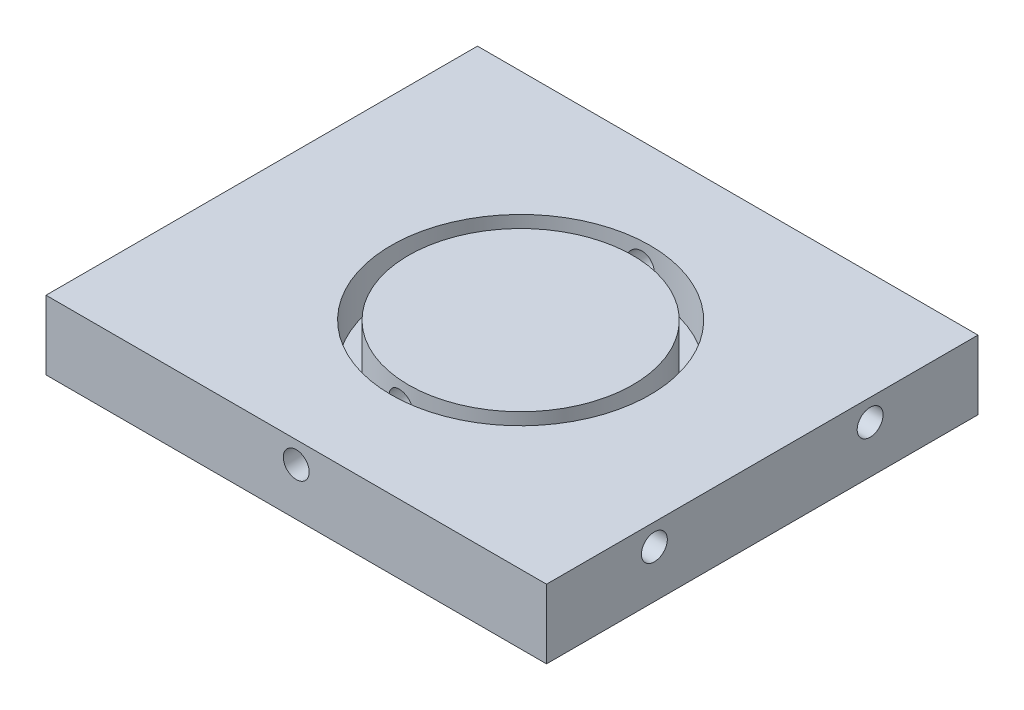
ISO-10303-21;
HEADER;
FILE_DESCRIPTION(('STEP AP214'),'2;1');
FILE_NAME('part.step','',(''),(''),'','','');
FILE_SCHEMA(('AUTOMOTIVE_DESIGN { 1 0 10303 214 1 1 1 1 }'));
ENDSEC;
DATA;
#1=APPLICATION_CONTEXT('core data for automotive mechanical design processes');
#2=APPLICATION_PROTOCOL_DEFINITION('international standard','automotive_design',2000,#1);
#3=PRODUCT_CONTEXT('',#1,'mechanical');
#4=PRODUCT('Part','Part','',(#3));
#5=PRODUCT_RELATED_PRODUCT_CATEGORY('part','',(#4));
#6=PRODUCT_DEFINITION_FORMATION('','',#4);
#7=PRODUCT_DEFINITION_CONTEXT('part definition',#1,'design');
#8=PRODUCT_DEFINITION('design','',#6,#7);
#9=PRODUCT_DEFINITION_SHAPE('','',#8);
#10=(LENGTH_UNIT() NAMED_UNIT(*) SI_UNIT(.MILLI.,.METRE.));
#11=(NAMED_UNIT(*) PLANE_ANGLE_UNIT() SI_UNIT($,.RADIAN.));
#12=(NAMED_UNIT(*) SI_UNIT($,.STERADIAN.) SOLID_ANGLE_UNIT());
#13=UNCERTAINTY_MEASURE_WITH_UNIT(LENGTH_MEASURE(1.E-05),#10,'distance_accuracy_value','');
#14=(GEOMETRIC_REPRESENTATION_CONTEXT(3) GLOBAL_UNCERTAINTY_ASSIGNED_CONTEXT((#13)) GLOBAL_UNIT_ASSIGNED_CONTEXT((#10,
#11,#12)) REPRESENTATION_CONTEXT('',''));
#15=CARTESIAN_POINT('',(0.,0.,0.));
#16=DIRECTION('',(0.,0.,1.));
#17=DIRECTION('',(1.,0.,0.));
#18=AXIS2_PLACEMENT_3D('',#15,#16,#17);
#19=CARTESIAN_POINT('',(-5.5,-45.,50.));
#20=DIRECTION('',(1.,0.,0.));
#21=DIRECTION('',(0.,1.,0.));
#22=AXIS2_PLACEMENT_3D('',#19,#20,#21);
#23=PLANE('',#22);
#24=CARTESIAN_POINT('',(-5.50000000000004,-47.5,12.5));
#25=DIRECTION('',(-1.,0.,0.));
#26=DIRECTION('',(0.,0.,1.));
#27=AXIS2_PLACEMENT_3D('',#24,#25,#26);
#28=CIRCLE('',#27,1.5);
#29=CARTESIAN_POINT('',(-5.50000000000004,-47.5,14.));
#30=VERTEX_POINT('',#29);
#31=EDGE_CURVE('E202',#30,#30,#28,.T.);
#32=ORIENTED_EDGE('',*,*,#31,.F.);
#33=EDGE_LOOP('',(#32));
#34=FACE_BOUND('',#33,.T.);
#35=CARTESIAN_POINT('',(-5.50000000000004,-47.5,37.5));
#36=DIRECTION('',(-1.,0.,0.));
#37=DIRECTION('',(0.,0.,1.));
#38=AXIS2_PLACEMENT_3D('',#35,#36,#37);
#39=CIRCLE('',#38,1.5);
#40=CARTESIAN_POINT('',(-5.50000000000004,-47.5,39.));
#41=VERTEX_POINT('',#40);
#42=EDGE_CURVE('E205',#41,#41,#39,.T.);
#43=ORIENTED_EDGE('',*,*,#42,.F.);
#44=EDGE_LOOP('',(#43));
#45=FACE_BOUND('',#44,.T.);
#46=DIRECTION('',(0.,-1.,0.));
#47=VECTOR('',#46,1.);
#48=CARTESIAN_POINT('',(-5.5,-45.,0.));
#49=LINE('',#48,#47);
#50=CARTESIAN_POINT('',(-5.5,-45.,0.));
#51=VERTEX_POINT('',#50);
#52=CARTESIAN_POINT('',(-5.5,-53.,0.));
#53=VERTEX_POINT('',#52);
#54=EDGE_CURVE('E115',#51,#53,#49,.T.);
#55=ORIENTED_EDGE('',*,*,#54,.T.);
#56=DIRECTION('',(0.,0.,-1.));
#57=VECTOR('',#56,1.);
#58=CARTESIAN_POINT('',(-5.5,-53.,50.));
#59=LINE('',#58,#57);
#60=CARTESIAN_POINT('',(-5.5,-53.,50.));
#61=VERTEX_POINT('',#60);
#62=EDGE_CURVE('E11',#61,#53,#59,.T.);
#63=ORIENTED_EDGE('',*,*,#62,.F.);
#64=DIRECTION('',(0.,-1.,0.));
#65=VECTOR('',#64,1.);
#66=CARTESIAN_POINT('',(-5.5,-45.,50.));
#67=LINE('',#66,#65);
#68=CARTESIAN_POINT('',(-5.5,-45.,50.));
#69=VERTEX_POINT('',#68);
#70=EDGE_CURVE('E96',#69,#61,#67,.T.);
#71=ORIENTED_EDGE('',*,*,#70,.F.);
#72=DIRECTION('',(0.,0.,-1.));
#73=VECTOR('',#72,1.);
#74=CARTESIAN_POINT('',(-5.5,-45.,50.));
#75=LINE('',#74,#73);
#76=EDGE_CURVE('E63',#69,#51,#75,.T.);
#77=ORIENTED_EDGE('',*,*,#76,.T.);
#78=EDGE_LOOP('',(#55,#63,#71,#77));
#79=FACE_BOUND('',#78,.T.);
#80=ADVANCED_FACE('F39',(#34,#45,#79),#23,.F.);
#81=CARTESIAN_POINT('',(-5.5,-53.,50.));
#82=DIRECTION('',(0.,1.,0.));
#83=DIRECTION('',(0.,0.,1.));
#84=AXIS2_PLACEMENT_3D('',#81,#82,#83);
#85=PLANE('',#84);
#86=DIRECTION('',(1.,0.,0.));
#87=VECTOR('',#86,1.);
#88=CARTESIAN_POINT('',(-5.5,-53.,0.));
#89=LINE('',#88,#87);
#90=CARTESIAN_POINT('',(52.5,-53.,0.));
#91=VERTEX_POINT('',#90);
#92=EDGE_CURVE('E102',#53,#91,#89,.T.);
#93=ORIENTED_EDGE('',*,*,#92,.T.);
#94=DIRECTION('',(0.,0.,-1.));
#95=VECTOR('',#94,1.);
#96=CARTESIAN_POINT('',(52.5,-53.,50.));
#97=LINE('',#96,#95);
#98=CARTESIAN_POINT('',(52.5,-53.,50.));
#99=VERTEX_POINT('',#98);
#100=EDGE_CURVE('E54',#99,#91,#97,.T.);
#101=ORIENTED_EDGE('',*,*,#100,.F.);
#102=DIRECTION('',(1.,0.,0.));
#103=VECTOR('',#102,1.);
#104=CARTESIAN_POINT('',(-5.5,-53.,50.));
#105=LINE('',#104,#103);
#106=EDGE_CURVE('E88',#61,#99,#105,.T.);
#107=ORIENTED_EDGE('',*,*,#106,.F.);
#108=ORIENTED_EDGE('',*,*,#62,.T.);
#109=EDGE_LOOP('',(#93,#101,#107,#108));
#110=FACE_BOUND('',#109,.T.);
#111=ADVANCED_FACE('F101',(#110),#85,.F.);
#112=CARTESIAN_POINT('',(52.5,-45.,50.));
#113=DIRECTION('',(1.,0.,0.));
#114=DIRECTION('',(0.,0.,-1.));
#115=AXIS2_PLACEMENT_3D('',#112,#113,#114);
#116=PLANE('',#115);
#117=CARTESIAN_POINT('',(52.5,-47.5,37.5));
#118=DIRECTION('',(1.,0.,0.));
#119=DIRECTION('',(0.,0.,-1.));
#120=AXIS2_PLACEMENT_3D('',#117,#118,#119);
#121=CIRCLE('',#120,1.5);
#122=CARTESIAN_POINT('',(52.5,-47.5,36.));
#123=VERTEX_POINT('',#122);
#124=EDGE_CURVE('E245',#123,#123,#121,.T.);
#125=ORIENTED_EDGE('',*,*,#124,.F.);
#126=EDGE_LOOP('',(#125));
#127=FACE_BOUND('',#126,.T.);
#128=CARTESIAN_POINT('',(52.5,-47.5,12.5));
#129=DIRECTION('',(1.,0.,0.));
#130=DIRECTION('',(0.,0.,-1.));
#131=AXIS2_PLACEMENT_3D('',#128,#129,#130);
#132=CIRCLE('',#131,1.5);
#133=CARTESIAN_POINT('',(52.5,-47.5,11.));
#134=VERTEX_POINT('',#133);
#135=EDGE_CURVE('E237',#134,#134,#132,.T.);
#136=ORIENTED_EDGE('',*,*,#135,.F.);
#137=EDGE_LOOP('',(#136));
#138=FACE_BOUND('',#137,.T.);
#139=DIRECTION('',(0.,-1.,0.));
#140=VECTOR('',#139,1.);
#141=CARTESIAN_POINT('',(52.5,-45.,0.));
#142=LINE('',#141,#140);
#143=CARTESIAN_POINT('',(52.5,-45.,0.));
#144=VERTEX_POINT('',#143);
#145=EDGE_CURVE('E121',#144,#91,#142,.T.);
#146=ORIENTED_EDGE('',*,*,#145,.F.);
#147=DIRECTION('',(0.,0.,-1.));
#148=VECTOR('',#147,1.);
#149=CARTESIAN_POINT('',(52.5,-45.,50.));
#150=LINE('',#149,#148);
#151=CARTESIAN_POINT('',(52.5,-45.,50.));
#152=VERTEX_POINT('',#151);
#153=EDGE_CURVE('E77',#152,#144,#150,.T.);
#154=ORIENTED_EDGE('',*,*,#153,.F.);
#155=DIRECTION('',(0.,-1.,0.));
#156=VECTOR('',#155,1.);
#157=CARTESIAN_POINT('',(52.5,-45.,50.));
#158=LINE('',#157,#156);
#159=EDGE_CURVE('E95',#152,#99,#158,.T.);
#160=ORIENTED_EDGE('',*,*,#159,.T.);
#161=ORIENTED_EDGE('',*,*,#100,.T.);
#162=EDGE_LOOP('',(#146,#154,#160,#161));
#163=FACE_BOUND('',#162,.T.);
#164=ADVANCED_FACE('F107',(#127,#138,#163),#116,.T.);
#165=CARTESIAN_POINT('',(-5.5,-45.,50.));
#166=DIRECTION('',(0.,1.,0.));
#167=DIRECTION('',(0.,0.,1.));
#168=AXIS2_PLACEMENT_3D('',#165,#166,#167);
#169=PLANE('',#168);
#170=CARTESIAN_POINT('',(24.5,-45.,25.));
#171=DIRECTION('',(0.,1.,0.));
#172=DIRECTION('',(0.,0.,1.));
#173=AXIS2_PLACEMENT_3D('',#170,#171,#172);
#174=CIRCLE('',#173,15.);
#175=CARTESIAN_POINT('',(24.5,-45.,40.));
#176=VERTEX_POINT('',#175);
#177=EDGE_CURVE('E209',#176,#176,#174,.T.);
#178=ORIENTED_EDGE('',*,*,#177,.F.);
#179=EDGE_LOOP('',(#178));
#180=FACE_BOUND('',#179,.T.);
#181=DIRECTION('',(1.,0.,0.));
#182=VECTOR('',#181,1.);
#183=CARTESIAN_POINT('',(-5.5,-45.,0.));
#184=LINE('',#183,#182);
#185=EDGE_CURVE('E124',#51,#144,#184,.T.);
#186=ORIENTED_EDGE('',*,*,#185,.F.);
#187=ORIENTED_EDGE('',*,*,#76,.F.);
#188=DIRECTION('',(1.,0.,0.));
#189=VECTOR('',#188,1.);
#190=CARTESIAN_POINT('',(-5.5,-45.,50.));
#191=LINE('',#190,#189);
#192=EDGE_CURVE('E109',#69,#152,#191,.T.);
#193=ORIENTED_EDGE('',*,*,#192,.T.);
#194=ORIENTED_EDGE('',*,*,#153,.T.);
#195=EDGE_LOOP('',(#186,#187,#193,#194));
#196=FACE_BOUND('',#195,.T.);
#197=ADVANCED_FACE('F181',(#180,#196),#169,.T.);
#198=CARTESIAN_POINT('',(0.,0.,50.));
#199=DIRECTION('',(0.,0.,1.));
#200=DIRECTION('',(1.,0.,0.));
#201=AXIS2_PLACEMENT_3D('',#198,#199,#200);
#202=PLANE('',#201);
#203=CARTESIAN_POINT('',(23.5,-47.5,50.));
#204=DIRECTION('',(0.,0.,-1.));
#205=DIRECTION('',(-1.,0.,0.));
#206=AXIS2_PLACEMENT_3D('',#203,#204,#205);
#207=CIRCLE('',#206,1.5);
#208=CARTESIAN_POINT('',(22.,-47.5,50.));
#209=VERTEX_POINT('',#208);
#210=EDGE_CURVE('E137',#209,#209,#207,.T.);
#211=ORIENTED_EDGE('',*,*,#210,.T.);
#212=EDGE_LOOP('',(#211));
#213=FACE_BOUND('',#212,.T.);
#214=ORIENTED_EDGE('',*,*,#70,.T.);
#215=ORIENTED_EDGE('',*,*,#106,.T.);
#216=ORIENTED_EDGE('',*,*,#159,.F.);
#217=ORIENTED_EDGE('',*,*,#192,.F.);
#218=EDGE_LOOP('',(#214,#215,#216,#217));
#219=FACE_BOUND('',#218,.T.);
#220=ADVANCED_FACE('F92',(#213,#219),#202,.T.);
#221=CARTESIAN_POINT('',(0.,0.,0.));
#222=DIRECTION('',(0.,0.,1.));
#223=DIRECTION('',(1.,0.,0.));
#224=AXIS2_PLACEMENT_3D('',#221,#222,#223);
#225=PLANE('',#224);
#226=CARTESIAN_POINT('',(23.5,-47.5,0.));
#227=DIRECTION('',(0.,0.,-1.));
#228=DIRECTION('',(-1.,0.,0.));
#229=AXIS2_PLACEMENT_3D('',#226,#227,#228);
#230=CIRCLE('',#229,1.5);
#231=CARTESIAN_POINT('',(22.,-47.5,0.));
#232=VERTEX_POINT('',#231);
#233=EDGE_CURVE('E165',#232,#232,#230,.T.);
#234=ORIENTED_EDGE('',*,*,#233,.F.);
#235=EDGE_LOOP('',(#234));
#236=FACE_BOUND('',#235,.T.);
#237=ORIENTED_EDGE('',*,*,#54,.F.);
#238=ORIENTED_EDGE('',*,*,#185,.T.);
#239=ORIENTED_EDGE('',*,*,#145,.T.);
#240=ORIENTED_EDGE('',*,*,#92,.F.);
#241=EDGE_LOOP('',(#237,#238,#239,#240));
#242=FACE_BOUND('',#241,.T.);
#243=ADVANCED_FACE('F176',(#236,#242),#225,.F.);
#244=CARTESIAN_POINT('',(24.5,-50.,25.));
#245=DIRECTION('',(0.,1.,0.));
#246=DIRECTION('',(0.,0.,1.));
#247=AXIS2_PLACEMENT_3D('',#244,#245,#246);
#248=CYLINDRICAL_SURFACE('',#247,15.);
#249=CARTESIAN_POINT('',(24.5,-48.6180339887499,40.));
#250=CARTESIAN_POINT('',(24.562792353238,-48.5618659776974,39.9999999273094));
#251=CARTESIAN_POINT('',(24.6208838158503,-48.5003581564799,39.9996043563319));
#252=CARTESIAN_POINT('',(24.72595981168,-48.3684181847015,39.9983905695386));
#253=CARTESIAN_POINT('',(24.772931785864,-48.2979760797655,39.9975718791152));
#254=CARTESIAN_POINT('',(24.8543649479623,-48.1502338072453,39.99586905058));
#255=CARTESIAN_POINT('',(24.8888319928025,-48.0729368714198,39.9949849433416));
#256=CARTESIAN_POINT('',(24.9442939822402,-47.9136720731185,39.9934445105049));
#257=CARTESIAN_POINT('',(24.9652921021757,-47.8317053165315,39.9927881312359));
#258=CARTESIAN_POINT('',(24.9932381044238,-47.6653852355015,39.991894956042));
#259=CARTESIAN_POINT('',(25.0001822524607,-47.5810312827931,39.9916582716361));
#260=CARTESIAN_POINT('',(24.9998104507153,-47.4123520030367,39.9916706731326));
#261=CARTESIAN_POINT('',(24.9924940082127,-47.3280266770783,39.9919197758194));
#262=CARTESIAN_POINT('',(24.9638161431028,-47.1618456026428,39.9928341984516));
#263=CARTESIAN_POINT('',(24.9424617981782,-47.0799886314014,39.9934993086447));
#264=CARTESIAN_POINT('',(24.8863217141132,-46.9210199569291,39.9950504711979));
#265=CARTESIAN_POINT('',(24.8515359006039,-46.8439082799752,39.9959365247814));
#266=CARTESIAN_POINT('',(24.7694988309606,-46.6965791515574,39.9976347173306));
#267=CARTESIAN_POINT('',(24.7222416725437,-46.6263649861102,39.9984468210528));
#268=CARTESIAN_POINT('',(24.6166083457938,-46.4948639816127,39.9996394624362));
#269=CARTESIAN_POINT('',(24.5582322156506,-46.4335771119016,40.0000200015798));
#270=CARTESIAN_POINT('',(24.4320393526911,-46.3216914820977,39.9999784211476));
#271=CARTESIAN_POINT('',(24.3642257106856,-46.2710892363641,39.9995565637883));
#272=CARTESIAN_POINT('',(24.2210799042835,-46.1819898565089,39.9975771087919));
#273=CARTESIAN_POINT('',(24.1457478960958,-46.1434924709536,39.9960195347473));
#274=CARTESIAN_POINT('',(23.9899180446767,-46.0797715112282,39.9915266586073));
#275=CARTESIAN_POINT('',(23.9094332194227,-46.0545158613062,39.988594718639));
#276=CARTESIAN_POINT('',(23.7454392678805,-46.0178328573119,39.9812339758208));
#277=CARTESIAN_POINT('',(23.6619301757651,-46.0064053470377,39.9768051898798));
#278=CARTESIAN_POINT('',(23.4943230369783,-45.9976665937383,39.9664845056108));
#279=CARTESIAN_POINT('',(23.4102254049045,-46.0003462508765,39.9605935527908));
#280=CARTESIAN_POINT('',(23.2437533596229,-46.0196756779531,39.9475355154578));
#281=CARTESIAN_POINT('',(23.1613790012947,-46.0363258921081,39.9403683903723));
#282=CARTESIAN_POINT('',(23.0002148174492,-46.0832096888632,39.9250539333135));
#283=CARTESIAN_POINT('',(22.9214460800378,-46.1135141218067,39.9169016530286));
#284=CARTESIAN_POINT('',(22.770129740452,-46.1868514276487,39.9001124404489));
#285=CARTESIAN_POINT('',(22.6975824694957,-46.2298849776771,39.8914754823914));
#286=CARTESIAN_POINT('',(22.560210733606,-46.3278382495193,39.8742075878157));
#287=CARTESIAN_POINT('',(22.4954454068788,-46.3828410293132,39.865577139024));
#288=CARTESIAN_POINT('',(22.3760681607444,-46.5030290060947,39.8489916746371));
#289=CARTESIAN_POINT('',(22.321456317729,-46.5682142796855,39.841036664124));
#290=CARTESIAN_POINT('',(22.2239861605324,-46.7069241677782,39.8264020065275));
#291=CARTESIAN_POINT('',(22.1811210921386,-46.780443955538,39.8197216272249));
#292=CARTESIAN_POINT('',(22.1083830987965,-46.9337829426933,39.8081576293496));
#293=CARTESIAN_POINT('',(22.0785092560552,-47.0136016966138,39.8032738838537));
#294=CARTESIAN_POINT('',(22.0329217592396,-47.1763550590977,39.7957445669148));
#295=CARTESIAN_POINT('',(22.0170587060804,-47.2592467230113,39.793075400165));
#296=CARTESIAN_POINT('',(21.99944001645,-47.4265556839183,39.7901075765534));
#297=CARTESIAN_POINT('',(21.9976833974087,-47.5109728742422,39.7898087545877));
#298=CARTESIAN_POINT('',(22.0082758882822,-47.6780268937381,39.7915968474477));
#299=CARTESIAN_POINT('',(22.0204820432474,-47.7606730965288,39.7936595841268));
#300=CARTESIAN_POINT('',(22.0583925626577,-47.9227202250515,39.7999634598376));
#301=CARTESIAN_POINT('',(22.0840970129419,-48.0021211301425,39.8042046127225));
#302=CARTESIAN_POINT('',(22.1483032340545,-48.1556317105165,39.8145393271029));
#303=CARTESIAN_POINT('',(22.1868319027658,-48.2297298633808,39.8206367797408));
#304=CARTESIAN_POINT('',(22.2755567105231,-48.3704352687845,39.8342124511775));
#305=CARTESIAN_POINT('',(22.3257536560549,-48.4370420030609,39.8416907654112));
#306=CARTESIAN_POINT('',(22.4370693925022,-48.5617176741495,39.8575740693727));
#307=CARTESIAN_POINT('',(22.4983104849109,-48.61967616147,39.8659889844142));
#308=CARTESIAN_POINT('',(22.6296001439708,-48.7245254908278,39.8830769488825));
#309=CARTESIAN_POINT('',(22.6996492013782,-48.7714157157517,39.891750012672));
#310=CARTESIAN_POINT('',(22.8472614104589,-48.8531855360378,39.9088569265127));
#311=CARTESIAN_POINT('',(22.9248835810385,-48.8879592273636,39.9172881037536));
#312=CARTESIAN_POINT('',(23.0849570892867,-48.943927864651,39.9333223956186));
#313=CARTESIAN_POINT('',(23.1674082006577,-48.965123446366,39.9409255489985));
#314=CARTESIAN_POINT('',(23.3346056759678,-48.9932561545366,39.9548946501727));
#315=CARTESIAN_POINT('',(23.4193460068746,-49.0002276394919,39.9612635455413));
#316=CARTESIAN_POINT('',(23.588904796731,-48.9997610144627,39.9725456864663));
#317=CARTESIAN_POINT('',(23.6737232670143,-48.9923203055756,39.9774586692985));
#318=CARTESIAN_POINT('',(23.8403540340811,-48.9633056593774,39.9857192995042));
#319=CARTESIAN_POINT('',(23.9221834167737,-48.9418325836234,39.9890778278578));
#320=CARTESIAN_POINT('',(24.0810523350007,-48.8854484515661,39.9943586171885));
#321=CARTESIAN_POINT('',(24.1580971248861,-48.8505524503972,39.9962824802054));
#322=CARTESIAN_POINT('',(24.2797029674199,-48.7826155745908,39.9984597880573));
#323=CARTESIAN_POINT('',(24.3262741867071,-48.7531165454756,39.9990609731497));
#324=CARTESIAN_POINT('',(24.4158998136255,-48.6891835492231,39.9998311023475));
#325=CARTESIAN_POINT('',(24.4589542299064,-48.654749594224,40.000000047516));
#326=CARTESIAN_POINT('',(24.5,-48.6180339887499,40.));
#327=B_SPLINE_CURVE_WITH_KNOTS('',3,(#249,#250,#251,#252,#253,#254,#255,#256,#257,#258,#259,
#260,#261,#262,#263,#264,#265,#266,#267,#268,#269,#270,#271,#272,#273,#274,#275,#276,#277,#278,
#279,#280,#281,#282,#283,#284,#285,#286,#287,#288,#289,#290,#291,#292,#293,#294,#295,#296,#297,
#298,#299,#300,#301,#302,#303,#304,#305,#306,#307,#308,#309,#310,#311,#312,#313,#314,#315,#316,
#317,#318,#319,#320,#321,#322,#323,#324,#325,#326),.UNSPECIFIED.,.T.,.F.,(4,2,2,2,2,2,2,2,2,2,2,
2,2,2,2,2,2,2,2,2,2,2,2,2,2,2,2,2,2,2,2,2,2,2,2,2,2,2,4),(0.,0.252543206012552,
0.505370303251981,0.758078830685049,1.0107277594349,1.2634438106295,1.51616859361576,
1.76876605449305,2.02136491400379,2.2740835354169,2.5268012888428,2.77943647043874,
3.03206640412767,3.28408152599206,3.53609380108175,3.78794353543168,4.03980127805724,
4.29298120960288,4.54617461156697,4.80118445355844,5.05619621408952,5.31106103770036,
5.56590785291206,5.81800319874273,6.07008098496437,6.3196008486299,6.56912229907351,
6.81917043593607,7.06923586072356,7.32226266989588,7.57530358329969,7.83050375721573,
8.08569198129116,8.34026306146166,8.59488005185742,8.84768674836169,9.1002107201396,
9.26529222026118,9.43037331434599),.UNSPECIFIED.);
#328=CARTESIAN_POINT('',(24.5,-48.6180339887499,40.));
#329=VERTEX_POINT('',#328);
#330=EDGE_CURVE('E164',#329,#329,#327,.T.);
#331=ORIENTED_EDGE('',*,*,#330,.T.);
#332=EDGE_LOOP('',(#331));
#333=FACE_BOUND('',#332,.T.);
#334=CARTESIAN_POINT('',(22.,-47.5,10.209800542251));
#335=CARTESIAN_POINT('',(22.0000037170164,-47.4164719520565,10.2097992925967));
#336=CARTESIAN_POINT('',(22.0070015492983,-47.332888352067,10.2086117878344));
#337=CARTESIAN_POINT('',(22.0347998140478,-47.1680516801838,10.2039539479485));
#338=CARTESIAN_POINT('',(22.0556155225208,-47.0868012915431,10.2004810863431));
#339=CARTESIAN_POINT('',(22.1104011630973,-46.9290551300245,10.1915367918623));
#340=CARTESIAN_POINT('',(22.1443599311275,-46.8525553856472,10.18606705541));
#341=CARTESIAN_POINT('',(22.224423990289,-46.7063679518007,10.1735578181361));
#342=CARTESIAN_POINT('',(22.2705272040692,-46.6366791000964,10.166518585814));
#343=CARTESIAN_POINT('',(22.3739923834816,-46.5054424128631,10.1513354266328));
#344=CARTESIAN_POINT('',(22.4314423878941,-46.443964975218,10.1431830260584));
#345=CARTESIAN_POINT('',(22.5557582399086,-46.3314814319289,10.12640424216));
#346=CARTESIAN_POINT('',(22.6226249250236,-46.2804762586737,10.1177778167181));
#347=CARTESIAN_POINT('',(22.7646538631595,-46.1898733724335,10.100545840343));
#348=CARTESIAN_POINT('',(22.8398928433593,-46.1503956536073,10.0919413735777));
#349=CARTESIAN_POINT('',(22.9960104949098,-46.0846669217563,10.0753837159087));
#350=CARTESIAN_POINT('',(23.0768891699993,-46.0584159175001,10.0674305254368));
#351=CARTESIAN_POINT('',(23.2419796368368,-46.0199303899289,10.0526174075064));
#352=CARTESIAN_POINT('',(23.3261900468648,-46.0076901179033,10.0457570326527));
#353=CARTESIAN_POINT('',(23.4955690135314,-45.9976095352281,10.0334263606892));
#354=CARTESIAN_POINT('',(23.5807375255496,-45.9997685567269,10.0279559991215));
#355=CARTESIAN_POINT('',(23.7489429178095,-46.0184012679837,10.0185795447231));
#356=CARTESIAN_POINT('',(23.8319908890001,-46.0347692281086,10.0146622086528));
#357=CARTESIAN_POINT('',(23.9942090352517,-46.0812415754496,10.0083100303608));
#358=CARTESIAN_POINT('',(24.0733793078956,-46.1113456167987,10.0058751508153));
#359=CARTESIAN_POINT('',(24.2252026438753,-46.1842718169181,10.0023257571382));
#360=CARTESIAN_POINT('',(24.2978843438715,-46.2270340877072,10.0012051461905));
#361=CARTESIAN_POINT('',(24.4350754696584,-46.3241191868543,9.9999833849772));
#362=CARTESIAN_POINT('',(24.4995848420123,-46.3784420907981,9.99988224137726));
#363=CARTESIAN_POINT('',(24.61867097158,-46.4971774543377,10.0003508330984));
#364=CARTESIAN_POINT('',(24.6732366956452,-46.5616009756255,10.0009213084548));
#365=CARTESIAN_POINT('',(24.7708082671465,-46.6986736955203,10.0023651369251));
#366=CARTESIAN_POINT('',(24.8138139787834,-46.7713229907438,10.0032384935968));
#367=CARTESIAN_POINT('',(24.8871364324129,-46.9229714863992,10.0049514816783));
#368=CARTESIAN_POINT('',(24.9174239735307,-47.0019848086566,10.0057910315185));
#369=CARTESIAN_POINT('',(24.9643080455105,-47.1639764809509,10.0071692903673));
#370=CARTESIAN_POINT('',(24.9809045958097,-47.2469548253585,10.007707999803));
#371=CARTESIAN_POINT('',(24.999935583748,-47.4145310331286,10.0083304116645));
#372=CARTESIAN_POINT('',(25.0023684850818,-47.4991290711779,10.0084140647311));
#373=CARTESIAN_POINT('',(24.9929986139889,-47.6675320874785,10.0081030763762));
#374=CARTESIAN_POINT('',(24.9811958437345,-47.7513370658509,10.0077084350276));
#375=CARTESIAN_POINT('',(24.9436981186081,-47.9157426220612,10.0065521016646));
#376=CARTESIAN_POINT('',(24.9180084394088,-47.9963444043263,10.0057905490527));
#377=CARTESIAN_POINT('',(24.8534694100341,-48.1520938961708,10.0041307258632));
#378=CARTESIAN_POINT('',(24.8146199638604,-48.2272415659586,10.0032324542884));
#379=CARTESIAN_POINT('',(24.7248370315212,-48.3699929724321,10.0016181688143));
#380=CARTESIAN_POINT('',(24.6738970428125,-48.437592620769,10.000902253421));
#381=CARTESIAN_POINT('',(24.5613881620804,-48.5632822010997,10.0000204127961));
#382=CARTESIAN_POINT('',(24.4998193194214,-48.6213721772576,9.99985448501025));
#383=CARTESIAN_POINT('',(24.3678496721089,-48.7263527941973,10.0004373744452));
#384=CARTESIAN_POINT('',(24.2974549748784,-48.7732511149821,10.0011855622061));
#385=CARTESIAN_POINT('',(24.1498137572699,-48.8545641785576,10.0039067341735));
#386=CARTESIAN_POINT('',(24.0725674020296,-48.8889792221169,10.0058796888677));
#387=CARTESIAN_POINT('',(23.9136433530125,-48.9442853951318,10.0112546803589));
#388=CARTESIAN_POINT('',(23.8319773572023,-48.9652104983021,10.0146530912673));
#389=CARTESIAN_POINT('',(23.6663717960068,-48.9931079635102,10.0229530668732));
#390=CARTESIAN_POINT('',(23.5824322382551,-49.0000803723877,10.0278546265246));
#391=CARTESIAN_POINT('',(23.414652016298,-48.9999182107249,10.0390812383607));
#392=CARTESIAN_POINT('',(23.330811368758,-48.9927815305051,10.0454065033014));
#393=CARTESIAN_POINT('',(23.1655901310205,-48.9646478516857,10.0592427787323));
#394=CARTESIAN_POINT('',(23.0842096371756,-48.9436503109552,10.0667538355928));
#395=CARTESIAN_POINT('',(22.9256741129557,-48.8882518893484,10.0826313449121));
#396=CARTESIAN_POINT('',(22.8485478203527,-48.853770195037,10.0910027261752));
#397=CARTESIAN_POINT('',(22.7011882276224,-48.7723932556032,10.1080630826901));
#398=CARTESIAN_POINT('',(22.6309550438259,-48.7254978010308,10.1167520632985));
#399=CARTESIAN_POINT('',(22.4988880265714,-48.6202458668424,10.1339305391321));
#400=CARTESIAN_POINT('',(22.4371115887586,-48.5618170671014,10.1424183762101));
#401=CARTESIAN_POINT('',(22.3242367758899,-48.4352905552504,10.1585272227046));
#402=CARTESIAN_POINT('',(22.2731407756498,-48.3671906984036,10.166148039166));
#403=CARTESIAN_POINT('',(22.1832210768714,-48.223376807645,10.1799255367343));
#404=CARTESIAN_POINT('',(22.1443737300865,-48.1476778226051,10.186085033418));
#405=CARTESIAN_POINT('',(22.0800217436238,-47.9907507192874,10.1964606288002));
#406=CARTESIAN_POINT('',(22.0545010563015,-47.9095293847795,10.2006790641472));
#407=CARTESIAN_POINT('',(22.0240620399435,-47.7731809630397,10.2057487863428));
#408=CARTESIAN_POINT('',(22.0150517266535,-47.7189569937221,10.2072629401952));
#409=CARTESIAN_POINT('',(22.0030195182262,-47.6098300184756,10.2092892233929));
#410=CARTESIAN_POINT('',(21.9999975557356,-47.554927020191,10.2098013640083));
#411=CARTESIAN_POINT('',(22.,-47.5,10.209800542251));
#412=B_SPLINE_CURVE_WITH_KNOTS('',3,(#334,#335,#336,#337,#338,#339,#340,#341,#342,#343,#344,
#345,#346,#347,#348,#349,#350,#351,#352,#353,#354,#355,#356,#357,#358,#359,#360,#361,#362,#363,
#364,#365,#366,#367,#368,#369,#370,#371,#372,#373,#374,#375,#376,#377,#378,#379,#380,#381,#382,
#383,#384,#385,#386,#387,#388,#389,#390,#391,#392,#393,#394,#395,#396,#397,#398,#399,#400,#401,
#402,#403,#404,#405,#406,#407,#408,#409,#410,#411),.UNSPECIFIED.,.T.,.F.,(4,2,2,2,2,2,2,2,2,2,2,
2,2,2,2,2,2,2,2,2,2,2,2,2,2,2,2,2,2,2,2,2,2,2,2,2,2,2,4),(0.,0.250382378651282,
0.501042023260319,0.751489216381358,1.00189359739832,1.25432310307462,1.50677507385172,
1.76176819768857,2.01676149057369,2.27165012021426,2.52652692798345,2.77952328158787,
3.03251326523445,3.28432494174068,3.53613826469583,3.78822931253811,4.04032332164536,
4.29299301412156,4.54566234787868,4.79835908770737,5.05105578897458,5.30365655750885,
5.55625916876479,5.80899794399034,6.06173554543243,6.31429920983768,6.56685678864136,
6.81877580352888,7.07069397271143,7.32264981312871,7.57461550871718,7.82811502097733,
8.08161881065899,8.33676581506606,8.59196949169133,8.84667739075899,9.10107786524201,
9.26572809940203,9.43037648166704),.UNSPECIFIED.);
#413=CARTESIAN_POINT('',(22.,-47.5,10.209800542251));
#414=VERTEX_POINT('',#413);
#415=EDGE_CURVE('E156',#414,#414,#412,.T.);
#416=ORIENTED_EDGE('',*,*,#415,.T.);
#417=EDGE_LOOP('',(#416));
#418=FACE_BOUND('',#417,.T.);
#419=CARTESIAN_POINT('',(24.5,-50.,25.));
#420=DIRECTION('',(0.,1.,0.));
#421=DIRECTION('',(0.,0.,1.));
#422=AXIS2_PLACEMENT_3D('',#419,#420,#421);
#423=CIRCLE('',#422,15.);
#424=CARTESIAN_POINT('',(24.5,-50.,40.));
#425=VERTEX_POINT('',#424);
#426=EDGE_CURVE('E118',#425,#425,#423,.T.);
#427=ORIENTED_EDGE('',*,*,#426,.F.);
#428=EDGE_LOOP('',(#427));
#429=FACE_BOUND('',#428,.T.);
#430=ORIENTED_EDGE('',*,*,#177,.T.);
#431=EDGE_LOOP('',(#430));
#432=FACE_BOUND('',#431,.T.);
#433=ADVANCED_FACE('F171',(#333,#418,#429,#432),#248,.F.);
#434=CARTESIAN_POINT('',(24.5,-50.,25.));
#435=DIRECTION('',(0.,1.,0.));
#436=DIRECTION('',(0.,0.,1.));
#437=AXIS2_PLACEMENT_3D('',#434,#435,#436);
#438=PLANE('',#437);
#439=CARTESIAN_POINT('',(24.5,-50.,25.));
#440=DIRECTION('',(0.,1.,0.));
#441=DIRECTION('',(0.,0.,1.));
#442=AXIS2_PLACEMENT_3D('',#439,#440,#441);
#443=CIRCLE('',#442,13.);
#444=CARTESIAN_POINT('',(24.5,-50.,38.));
#445=VERTEX_POINT('',#444);
#446=EDGE_CURVE('E213',#445,#445,#443,.T.);
#447=ORIENTED_EDGE('',*,*,#446,.F.);
#448=EDGE_LOOP('',(#447));
#449=FACE_BOUND('',#448,.T.);
#450=ORIENTED_EDGE('',*,*,#426,.T.);
#451=EDGE_LOOP('',(#450));
#452=FACE_BOUND('',#451,.T.);
#453=ADVANCED_FACE('F175',(#449,#452),#438,.T.);
#454=CARTESIAN_POINT('',(24.5,-50.,25.));
#455=DIRECTION('',(0.,1.,0.));
#456=DIRECTION('',(0.,0.,1.));
#457=AXIS2_PLACEMENT_3D('',#454,#455,#456);
#458=CYLINDRICAL_SURFACE('',#457,13.);
#459=CARTESIAN_POINT('',(24.5,-48.6180339887499,38.));
#460=CARTESIAN_POINT('',(24.5627905001052,-48.5618677070371,37.9999999238787));
#461=CARTESIAN_POINT('',(24.6208791593488,-48.5003630602801,37.9995435297477));
#462=CARTESIAN_POINT('',(24.7259491731342,-48.3684324882551,37.998143101571));
#463=CARTESIAN_POINT('',(24.7729182688352,-48.297996847057,37.9971985329505));
#464=CARTESIAN_POINT('',(24.8543478456256,-48.1502685872187,37.9952337737234));
#465=CARTESIAN_POINT('',(24.8888141471826,-48.0729791801434,37.9942136185718));
#466=CARTESIAN_POINT('',(24.9442773996981,-47.9137286220513,37.99243600144));
#467=CARTESIAN_POINT('',(24.9652774693276,-47.8317685575124,37.991678478655));
#468=CARTESIAN_POINT('',(24.9932301780851,-47.6654562414023,37.9906474967386));
#469=CARTESIAN_POINT('',(25.0001783316655,-47.5811032346844,37.9903741921793));
#470=CARTESIAN_POINT('',(24.9998146883254,-47.4124252878811,37.9903881903367));
#471=CARTESIAN_POINT('',(24.9925024206295,-47.3281003488144,37.9906755115613));
#472=CARTESIAN_POINT('',(24.9638356117433,-47.1619335332838,37.9917304119082));
#473=CARTESIAN_POINT('',(24.9424904081702,-47.080090043503,37.9924976716596));
#474=CARTESIAN_POINT('',(24.8863734205315,-46.9211460010676,37.9942871383504));
#475=CARTESIAN_POINT('',(24.8516015286984,-46.8440454864877,37.9953093473361));
#476=CARTESIAN_POINT('',(24.7695896276344,-46.696722892158,37.9972688537347));
#477=CARTESIAN_POINT('',(24.7223417698769,-46.6265051805859,37.9982060971962));
#478=CARTESIAN_POINT('',(24.6167256942001,-46.4949945137188,37.9995829099732));
#479=CARTESIAN_POINT('',(24.5583575204068,-46.4337015230118,38.0000224812635));
#480=CARTESIAN_POINT('',(24.4321860037717,-46.3218082275492,37.9999757991837));
#481=CARTESIAN_POINT('',(24.3643867686412,-46.2712032916334,37.9994899477196));
#482=CARTESIAN_POINT('',(24.2212738733969,-46.1820968186436,37.9972083599556));
#483=CARTESIAN_POINT('',(24.1459604238768,-46.1435949424943,37.9954126603567));
#484=CARTESIAN_POINT('',(23.9902417060247,-46.079888392043,37.9902344037567));
#485=CARTESIAN_POINT('',(23.9098536961152,-46.0546411083953,37.9868569985208));
#486=CARTESIAN_POINT('',(23.7460774353893,-46.0179446143406,37.9783789695478));
#487=CARTESIAN_POINT('',(23.662689228584,-46.0064952016124,37.9732783710797));
#488=CARTESIAN_POINT('',(23.4953661445771,-45.9976712743853,37.9613941735576));
#489=CARTESIAN_POINT('',(23.4114318004444,-46.0002846383188,37.9546120287408));
#490=CARTESIAN_POINT('',(23.2452992922644,-46.0194189909523,37.9395782622973));
#491=CARTESIAN_POINT('',(23.1631012003681,-46.0359405564542,37.9313265797371));
#492=CARTESIAN_POINT('',(23.0021439050458,-46.0825347420774,37.9136761297973));
#493=CARTESIAN_POINT('',(22.9234126073003,-46.112700845843,37.9042697808624));
#494=CARTESIAN_POINT('',(22.7721533576835,-46.1857344504237,37.8848890986071));
#495=CARTESIAN_POINT('',(22.6996258449612,-46.2286028494421,37.874914725161));
#496=CARTESIAN_POINT('',(22.5620877878935,-46.3263284103734,37.8549359468844));
#497=CARTESIAN_POINT('',(22.4971559744697,-46.3812965681221,37.8449321708879));
#498=CARTESIAN_POINT('',(22.3774420206758,-46.5014726183487,37.8256942005515));
#499=CARTESIAN_POINT('',(22.3226599996997,-46.5666806312633,37.8164600152652));
#500=CARTESIAN_POINT('',(22.2248602969109,-46.7055047640162,37.7994612931972));
#501=CARTESIAN_POINT('',(22.1818350614827,-46.7791154419162,37.7916958137791));
#502=CARTESIAN_POINT('',(22.1088084499221,-46.9327124352456,37.7782467257097));
#503=CARTESIAN_POINT('',(22.0788058247886,-47.0126981383737,37.7725629174131));
#504=CARTESIAN_POINT('',(22.0331049006886,-47.1755495378852,37.7638147276327));
#505=CARTESIAN_POINT('',(22.0172070931023,-47.2583572738168,37.7607138511021));
#506=CARTESIAN_POINT('',(21.9994950944014,-47.4255190759528,37.7572551693917));
#507=CARTESIAN_POINT('',(21.9976795835819,-47.509872996516,37.7568971071725));
#508=CARTESIAN_POINT('',(22.008115689351,-47.6765119054608,37.7589395285436));
#509=CARTESIAN_POINT('',(22.0201760191786,-47.7588094241971,37.7613025014222));
#510=CARTESIAN_POINT('',(22.057672036268,-47.9201810123732,37.7685314237759));
#511=CARTESIAN_POINT('',(22.0831078441279,-47.9992550527419,37.7733973958189));
#512=CARTESIAN_POINT('',(22.1466693034802,-48.1522072367917,37.7852601180446));
#513=CARTESIAN_POINT('',(22.1848299023941,-48.2260703848286,37.7922627317587));
#514=CARTESIAN_POINT('',(22.272710099716,-48.3663796644369,37.8078555721114));
#515=CARTESIAN_POINT('',(22.3224307377024,-48.4328251281503,37.8164459415205));
#516=CARTESIAN_POINT('',(22.4329172927038,-48.5575364540831,37.8347320075393));
#517=CARTESIAN_POINT('',(22.4938453992262,-48.615656397445,37.8444430314194));
#518=CARTESIAN_POINT('',(22.6245208370538,-48.7208911367147,37.864172631921));
#519=CARTESIAN_POINT('',(22.6942688233633,-48.7680051145288,37.8741912313424));
#520=CARTESIAN_POINT('',(22.8415344688232,-48.8504159563125,37.893993448732));
#521=CARTESIAN_POINT('',(22.9191320990679,-48.8855710188846,37.9037730512176));
#522=CARTESIAN_POINT('',(23.0792527384102,-48.942284540773,37.9223824198969));
#523=CARTESIAN_POINT('',(23.1617755071548,-48.963843662995,37.9312122323826));
#524=CARTESIAN_POINT('',(23.3291576680517,-48.992649367201,37.9474388868881));
#525=CARTESIAN_POINT('',(23.4140090637443,-48.9999399110869,37.9548400668404));
#526=CARTESIAN_POINT('',(23.5838722730202,-49.0000593407216,37.9679591812696));
#527=CARTESIAN_POINT('',(23.6688841097334,-48.9928859519382,37.9736768508433));
#528=CARTESIAN_POINT('',(23.8357479169673,-48.9643673552797,37.9832851274486));
#529=CARTESIAN_POINT('',(23.9176224379352,-48.943159331159,37.9871928041206));
#530=CARTESIAN_POINT('',(24.0766423215389,-48.8872889747939,37.9933479263215));
#531=CARTESIAN_POINT('',(24.1537927456948,-48.8526413448468,37.9955971783161));
#532=CARTESIAN_POINT('',(24.2763082712732,-48.7847074123476,37.9981677546362));
#533=CARTESIAN_POINT('',(24.3236265228179,-48.7548935465925,37.9988832760369));
#534=CARTESIAN_POINT('',(24.4146524282839,-48.69018033535,37.9997994232065));
#535=CARTESIAN_POINT('',(24.4583600927582,-48.6552810047271,38.0000000504803));
#536=CARTESIAN_POINT('',(24.5,-48.6180339887499,38.));
#537=B_SPLINE_CURVE_WITH_KNOTS('',3,(#459,#460,#461,#462,#463,#464,#465,#466,#467,#468,#469,
#470,#471,#472,#473,#474,#475,#476,#477,#478,#479,#480,#481,#482,#483,#484,#485,#486,#487,#488,
#489,#490,#491,#492,#493,#494,#495,#496,#497,#498,#499,#500,#501,#502,#503,#504,#505,#506,#507,
#508,#509,#510,#511,#512,#513,#514,#515,#516,#517,#518,#519,#520,#521,#522,#523,#524,#525,#526,
#527,#528,#529,#530,#531,#532,#533,#534,#535,#536),.UNSPECIFIED.,.T.,.F.,(4,2,2,2,2,2,2,2,2,2,2,
2,2,2,2,2,2,2,2,2,2,2,2,2,2,2,2,2,2,2,2,2,2,2,2,2,2,2,4),(0.,0.252532757548079,
0.505342638458872,0.758034676443342,1.01066817182812,1.26338229826703,1.51610476763031,
1.76865924360796,2.02121574672568,2.27393151114376,2.52664627279717,2.77925130685369,
3.03184926337819,3.28363014626755,3.53540733719286,3.78696754073287,4.03853817750731,
4.29185915358449,4.54519804674451,4.80096569136208,5.05673634443279,5.31234227899257,
5.56792369291713,5.81982953266856,6.07171176509628,6.32016283555316,6.56861614617323,
6.81775750855126,7.06692128454129,7.32002411949192,7.57314576205819,7.82917190195219,
8.08518555765504,8.34040917834785,8.59567293747222,8.84847772352319,9.1010067294435,
9.26847587394508,9.43594452895187),.UNSPECIFIED.);
#538=CARTESIAN_POINT('',(24.5,-48.6180339887499,38.));
#539=VERTEX_POINT('',#538);
#540=EDGE_CURVE('E42',#539,#539,#537,.T.);
#541=ORIENTED_EDGE('',*,*,#540,.F.);
#542=EDGE_LOOP('',(#541));
#543=FACE_BOUND('',#542,.T.);
#544=CARTESIAN_POINT('',(22.,-47.5,12.2426491778269));
#545=CARTESIAN_POINT('',(22.0000036985143,-47.4167144399532,12.2426477451467));
#546=CARTESIAN_POINT('',(22.0069613565466,-47.3333751782231,12.2412788900949));
#547=CARTESIAN_POINT('',(22.0345931952684,-47.1690300525714,12.2359113350985));
#548=CARTESIAN_POINT('',(22.0552821238188,-47.0880267953126,12.2319098076129));
#549=CARTESIAN_POINT('',(22.1097135494413,-46.9307747139905,12.2216083764848));
#550=CARTESIAN_POINT('',(22.1434433534907,-46.854521350272,12.2153107080746));
#551=CARTESIAN_POINT('',(22.2229440478047,-46.7087863794536,12.2009125127224));
#552=CARTESIAN_POINT('',(22.268713177001,-46.639303783986,12.192812249484));
#553=CARTESIAN_POINT('',(22.3715465885388,-46.5082311534795,12.1753195932469));
#554=CARTESIAN_POINT('',(22.4287268741978,-46.4467338743741,12.1659142600772));
#555=CARTESIAN_POINT('',(22.5524790720351,-46.3341513091373,12.1465538546635));
#556=CARTESIAN_POINT('',(22.6190519734725,-46.2830671211321,12.1365987245805));
#557=CARTESIAN_POINT('',(22.7607374997671,-46.1920726661108,12.116671843533));
#558=CARTESIAN_POINT('',(22.8359531996238,-46.1523224112578,12.1067016795802));
#559=CARTESIAN_POINT('',(22.9920969318179,-46.086059674258,12.0875095506027));
#560=CARTESIAN_POINT('',(23.0730249766613,-46.0595472210939,12.0782875872161));
#561=CARTESIAN_POINT('',(23.238287311204,-46.020571062548,12.0611061091321));
#562=CARTESIAN_POINT('',(23.3226199164985,-46.0081004960848,12.0531459795184));
#563=CARTESIAN_POINT('',(23.4923140164618,-45.9976131864458,12.0388342913895));
#564=CARTESIAN_POINT('',(23.577675447298,-45.9995955511132,12.0324826336108));
#565=CARTESIAN_POINT('',(23.7461068909058,-46.0179280130815,12.0216064172011));
#566=CARTESIAN_POINT('',(23.8291911750787,-46.0341367980021,12.0170645254076));
#567=CARTESIAN_POINT('',(23.9915246226086,-46.0803085621627,12.0096936905767));
#568=CARTESIAN_POINT('',(24.0707739164912,-46.1102710729236,12.0068646892026));
#569=CARTESIAN_POINT('',(24.2226618988294,-46.1828813027071,12.0027377150888));
#570=CARTESIAN_POINT('',(24.295338750189,-46.2254487028385,12.0014302992833));
#571=CARTESIAN_POINT('',(24.4325655757664,-46.3221348071774,11.9999935099344));
#572=CARTESIAN_POINT('',(24.4971154805245,-46.3762536101025,11.9998641464589));
#573=CARTESIAN_POINT('',(24.6163481659974,-46.4945983373378,12.0003834310134));
#574=CARTESIAN_POINT('',(24.6710166728566,-46.5588386357178,12.0010331943322));
#575=CARTESIAN_POINT('',(24.7688332676426,-46.6955576670321,12.0026876096629));
#576=CARTESIAN_POINT('',(24.8119811749539,-46.7680365291019,12.0036922672381));
#577=CARTESIAN_POINT('',(24.8856547108972,-46.9194236841811,12.0056689521325));
#578=CARTESIAN_POINT('',(24.9161414580569,-46.9983509044208,12.0066408706374));
#579=CARTESIAN_POINT('',(24.963437108763,-47.160205527946,12.0082414356705));
#580=CARTESIAN_POINT('',(24.98024603688,-47.2431329240453,12.0088700828153));
#581=CARTESIAN_POINT('',(24.9997091515809,-47.4106488284204,12.0096040222478));
#582=CARTESIAN_POINT('',(25.0023610310091,-47.4952376051949,12.0097092292308));
#583=CARTESIAN_POINT('',(24.9934280040314,-47.6636587683682,12.0093669186554));
#584=CARTESIAN_POINT('',(24.9818431021487,-47.7474911550074,12.0089194012726));
#585=CARTESIAN_POINT('',(24.9447766571976,-47.9119758919245,12.0075978486112));
#586=CARTESIAN_POINT('',(24.9193022591763,-47.9926298543956,12.0067240326538));
#587=CARTESIAN_POINT('',(24.8551845426594,-48.1485199983588,12.0048137157504));
#588=CARTESIAN_POINT('',(24.8165410956516,-48.2237561269716,12.0037772132168));
#589=CARTESIAN_POINT('',(24.7271463471864,-48.3667325390396,12.0019079476781));
#590=CARTESIAN_POINT('',(24.6763864020307,-48.4344674205046,12.0010753309846));
#591=CARTESIAN_POINT('',(24.5642114292213,-48.5604564774401,12.0000379103575));
#592=CARTESIAN_POINT('',(24.5027964665997,-48.6187107107709,11.9998331025923));
#593=CARTESIAN_POINT('',(24.3711183221462,-48.7240319917945,12.0004726196288));
#594=CARTESIAN_POINT('',(24.300863074282,-48.7711089628145,12.0013160096465));
#595=CARTESIAN_POINT('',(24.1534756475306,-48.8528001214077,12.0044105099713));
#596=CARTESIAN_POINT('',(24.0763436863585,-48.8874147033622,12.0066615757254));
#597=CARTESIAN_POINT('',(23.9176943946664,-48.9431132283656,12.0128064681613));
#598=CARTESIAN_POINT('',(23.8361926597499,-48.964242216385,12.0166947531428));
#599=CARTESIAN_POINT('',(23.6709050085448,-48.9925891881453,12.026201351615));
#600=CARTESIAN_POINT('',(23.5871191042916,-48.9998072451695,12.0318196559916));
#601=CARTESIAN_POINT('',(23.4196335671165,-49.0001851551001,12.0446974551815));
#602=CARTESIAN_POINT('',(23.3359339477255,-48.9933430639867,12.051957176821));
#603=CARTESIAN_POINT('',(23.1709679062031,-48.9658551751415,12.0678484337497));
#604=CARTESIAN_POINT('',(23.089701606104,-48.9452086863189,12.076480037703));
#605=CARTESIAN_POINT('',(22.9311924976868,-48.8905191027321,12.0947583091682));
#606=CARTESIAN_POINT('',(22.8539871827468,-48.8563699003463,12.104412561955));
#607=CARTESIAN_POINT('',(22.7064182117226,-48.7756573357951,12.1241072913294));
#608=CARTESIAN_POINT('',(22.6360548017889,-48.7290935272157,12.1341477817947));
#609=CARTESIAN_POINT('',(22.5035077466491,-48.624366272461,12.1540451415305));
#610=CARTESIAN_POINT('',(22.44140121082,-48.5661047235105,12.1638996296907));
#611=CARTESIAN_POINT('',(22.3278444202528,-48.4398202365015,12.1826265807022));
#612=CARTESIAN_POINT('',(22.2763964669416,-48.3717951956426,12.1914988312743));
#613=CARTESIAN_POINT('',(22.1857977898555,-48.2280616862678,12.2075574553511));
#614=CARTESIAN_POINT('',(22.1466165179607,-48.1523729358533,12.2147480053565));
#615=CARTESIAN_POINT('',(22.0816136311051,-47.9953604503517,12.2268832569133));
#616=CARTESIAN_POINT('',(22.0557759078805,-47.9140436446067,12.2318306654883));
#617=CARTESIAN_POINT('',(22.0247222175672,-47.7768716707582,12.2378235727496));
#618=CARTESIAN_POINT('',(22.0154653186313,-47.7219304349967,12.2396266725969));
#619=CARTESIAN_POINT('',(22.0031030231375,-47.6113341255312,12.2420399444175));
#620=CARTESIAN_POINT('',(21.9999975274248,-47.555679063348,12.2426501356195));
#621=CARTESIAN_POINT('',(22.,-47.5,12.2426491778269));
#622=B_SPLINE_CURVE_WITH_KNOTS('',3,(#544,#545,#546,#547,#548,#549,#550,#551,#552,#553,#554,
#555,#556,#557,#558,#559,#560,#561,#562,#563,#564,#565,#566,#567,#568,#569,#570,#571,#572,#573,
#574,#575,#576,#577,#578,#579,#580,#581,#582,#583,#584,#585,#586,#587,#588,#589,#590,#591,#592,
#593,#594,#595,#596,#597,#598,#599,#600,#601,#602,#603,#604,#605,#606,#607,#608,#609,#610,#611,
#612,#613,#614,#615,#616,#617,#618,#619,#620,#621),.UNSPECIFIED.,.T.,.F.,(4,2,2,2,2,2,2,2,2,2,2,
2,2,2,2,2,2,2,2,2,2,2,2,2,2,2,2,2,2,2,2,2,2,2,2,2,2,2,4),(0.,0.249651695762386,0.49957196095546,
0.749249582174177,0.998890701753524,1.25121230683732,1.50356050707466,1.75931247568012,
2.01506500422598,2.27069251385947,2.52630424413918,2.77940533350004,3.03249780237423,
3.2840110416211,3.53552643036914,3.78740228356328,4.03928208533445,4.29192977135639,
4.54457700352243,4.7972654080197,5.04995373223415,5.30251219076691,5.55507311400038,
5.80781475110039,6.06055484566347,6.31306970794367,6.56557657850526,6.81723554229896,
7.06889318033924,7.32058561604615,7.57229065319795,7.82601426519513,8.07974700201026,
8.33570392336846,8.59171605409532,8.84708546250701,9.10214586538329,9.26904870714422,
9.43594885856874),.UNSPECIFIED.);
#623=CARTESIAN_POINT('',(22.,-47.5,12.2426491778269));
#624=VERTEX_POINT('',#623);
#625=EDGE_CURVE('E131',#624,#624,#622,.T.);
#626=ORIENTED_EDGE('',*,*,#625,.F.);
#627=EDGE_LOOP('',(#626));
#628=FACE_BOUND('',#627,.T.);
#629=ORIENTED_EDGE('',*,*,#446,.T.);
#630=EDGE_LOOP('',(#629));
#631=FACE_BOUND('',#630,.T.);
#632=CARTESIAN_POINT('',(24.5,-45.,25.));
#633=DIRECTION('',(0.,1.,0.));
#634=DIRECTION('',(0.,0.,1.));
#635=AXIS2_PLACEMENT_3D('',#632,#633,#634);
#636=CIRCLE('',#635,13.);
#637=CARTESIAN_POINT('',(24.5,-45.,38.));
#638=VERTEX_POINT('',#637);
#639=EDGE_CURVE('E217',#638,#638,#636,.T.);
#640=ORIENTED_EDGE('',*,*,#639,.F.);
#641=EDGE_LOOP('',(#640));
#642=FACE_BOUND('',#641,.T.);
#643=ADVANCED_FACE('F138',(#543,#628,#631,#642),#458,.T.);
#644=ORIENTED_EDGE('',*,*,#639,.T.);
#645=EDGE_LOOP('',(#644));
#646=FACE_BOUND('',#645,.T.);
#647=ADVANCED_FACE('F189',(#646),#169,.T.);
#648=CARTESIAN_POINT('',(4.49999999999996,-47.5,37.5));
#649=DIRECTION('',(-1.,0.,0.));
#650=DIRECTION('',(0.,0.,1.));
#651=AXIS2_PLACEMENT_3D('',#648,#649,#650);
#652=CYLINDRICAL_SURFACE('',#651,1.5);
#653=CARTESIAN_POINT('',(4.49999999999996,-47.5,37.5));
#654=DIRECTION('',(-1.,0.,0.));
#655=DIRECTION('',(0.,0.,1.));
#656=AXIS2_PLACEMENT_3D('',#653,#654,#655);
#657=CIRCLE('',#656,1.5);
#658=CARTESIAN_POINT('',(4.49999999999996,-47.5,39.));
#659=VERTEX_POINT('',#658);
#660=EDGE_CURVE('E227',#659,#659,#657,.T.);
#661=ORIENTED_EDGE('',*,*,#660,.F.);
#662=EDGE_LOOP('',(#661));
#663=FACE_BOUND('',#662,.T.);
#664=ORIENTED_EDGE('',*,*,#42,.T.);
#665=EDGE_LOOP('',(#664));
#666=FACE_BOUND('',#665,.T.);
#667=ADVANCED_FACE('F282',(#663,#666),#652,.F.);
#668=CARTESIAN_POINT('',(4.49999999999996,-47.5,37.5));
#669=DIRECTION('',(-1.,0.,0.));
#670=DIRECTION('',(0.,0.,1.));
#671=AXIS2_PLACEMENT_3D('',#668,#669,#670);
#672=PLANE('',#671);
#673=ORIENTED_EDGE('',*,*,#660,.T.);
#674=EDGE_LOOP('',(#673));
#675=FACE_BOUND('',#674,.T.);
#676=ADVANCED_FACE('F279',(#675),#672,.T.);
#677=CARTESIAN_POINT('',(4.49999999999996,-47.5,12.5));
#678=DIRECTION('',(-1.,0.,0.));
#679=DIRECTION('',(0.,0.,1.));
#680=AXIS2_PLACEMENT_3D('',#677,#678,#679);
#681=CYLINDRICAL_SURFACE('',#680,1.5);
#682=CARTESIAN_POINT('',(4.49999999999996,-47.5,12.5));
#683=DIRECTION('',(-1.,0.,0.));
#684=DIRECTION('',(0.,0.,1.));
#685=AXIS2_PLACEMENT_3D('',#682,#683,#684);
#686=CIRCLE('',#685,1.5);
#687=CARTESIAN_POINT('',(4.49999999999996,-47.5,14.));
#688=VERTEX_POINT('',#687);
#689=EDGE_CURVE('E221',#688,#688,#686,.T.);
#690=ORIENTED_EDGE('',*,*,#689,.F.);
#691=EDGE_LOOP('',(#690));
#692=FACE_BOUND('',#691,.T.);
#693=ORIENTED_EDGE('',*,*,#31,.T.);
#694=EDGE_LOOP('',(#693));
#695=FACE_BOUND('',#694,.T.);
#696=ADVANCED_FACE('F272',(#692,#695),#681,.F.);
#697=CARTESIAN_POINT('',(4.49999999999996,-47.5,12.5));
#698=DIRECTION('',(-1.,0.,0.));
#699=DIRECTION('',(0.,0.,1.));
#700=AXIS2_PLACEMENT_3D('',#697,#698,#699);
#701=PLANE('',#700);
#702=ORIENTED_EDGE('',*,*,#689,.T.);
#703=EDGE_LOOP('',(#702));
#704=FACE_BOUND('',#703,.T.);
#705=ADVANCED_FACE('F263',(#704),#701,.T.);
#706=CARTESIAN_POINT('',(42.5,-47.5,12.5));
#707=DIRECTION('',(1.,0.,0.));
#708=DIRECTION('',(0.,0.,-1.));
#709=AXIS2_PLACEMENT_3D('',#706,#707,#708);
#710=CYLINDRICAL_SURFACE('',#709,1.5);
#711=CARTESIAN_POINT('',(42.5,-47.5,12.5));
#712=DIRECTION('',(1.,0.,0.));
#713=DIRECTION('',(0.,0.,-1.));
#714=AXIS2_PLACEMENT_3D('',#711,#712,#713);
#715=CIRCLE('',#714,1.5);
#716=CARTESIAN_POINT('',(42.5,-47.5,11.));
#717=VERTEX_POINT('',#716);
#718=EDGE_CURVE('E241',#717,#717,#715,.T.);
#719=ORIENTED_EDGE('',*,*,#718,.F.);
#720=EDGE_LOOP('',(#719));
#721=FACE_BOUND('',#720,.T.);
#722=ORIENTED_EDGE('',*,*,#135,.T.);
#723=EDGE_LOOP('',(#722));
#724=FACE_BOUND('',#723,.T.);
#725=ADVANCED_FACE('F261',(#721,#724),#710,.F.);
#726=CARTESIAN_POINT('',(42.5,-47.5,12.5));
#727=DIRECTION('',(1.,0.,0.));
#728=DIRECTION('',(0.,0.,-1.));
#729=AXIS2_PLACEMENT_3D('',#726,#727,#728);
#730=PLANE('',#729);
#731=ORIENTED_EDGE('',*,*,#718,.T.);
#732=EDGE_LOOP('',(#731));
#733=FACE_BOUND('',#732,.T.);
#734=ADVANCED_FACE('F256',(#733),#730,.T.);
#735=CARTESIAN_POINT('',(42.5,-47.5,37.5));
#736=DIRECTION('',(1.,0.,0.));
#737=DIRECTION('',(0.,0.,-1.));
#738=AXIS2_PLACEMENT_3D('',#735,#736,#737);
#739=CYLINDRICAL_SURFACE('',#738,1.5);
#740=CARTESIAN_POINT('',(42.5,-47.5,37.5));
#741=DIRECTION('',(1.,0.,0.));
#742=DIRECTION('',(0.,0.,-1.));
#743=AXIS2_PLACEMENT_3D('',#740,#741,#742);
#744=CIRCLE('',#743,1.5);
#745=CARTESIAN_POINT('',(42.5,-47.5,36.));
#746=VERTEX_POINT('',#745);
#747=EDGE_CURVE('E228',#746,#746,#744,.T.);
#748=ORIENTED_EDGE('',*,*,#747,.F.);
#749=EDGE_LOOP('',(#748));
#750=FACE_BOUND('',#749,.T.);
#751=ORIENTED_EDGE('',*,*,#124,.T.);
#752=EDGE_LOOP('',(#751));
#753=FACE_BOUND('',#752,.T.);
#754=ADVANCED_FACE('F253',(#750,#753),#739,.F.);
#755=CARTESIAN_POINT('',(42.5,-47.5,37.5));
#756=DIRECTION('',(1.,0.,0.));
#757=DIRECTION('',(0.,0.,-1.));
#758=AXIS2_PLACEMENT_3D('',#755,#756,#757);
#759=PLANE('',#758);
#760=ORIENTED_EDGE('',*,*,#747,.T.);
#761=EDGE_LOOP('',(#760));
#762=FACE_BOUND('',#761,.T.);
#763=ADVANCED_FACE('F147',(#762),#759,.T.);
#764=CARTESIAN_POINT('',(23.5,-47.5,50.));
#765=DIRECTION('',(0.,0.,-1.));
#766=DIRECTION('',(-1.,0.,0.));
#767=AXIS2_PLACEMENT_3D('',#764,#765,#766);
#768=CYLINDRICAL_SURFACE('',#767,1.5);
#769=ORIENTED_EDGE('',*,*,#540,.T.);
#770=EDGE_LOOP('',(#769));
#771=FACE_BOUND('',#770,.T.);
#772=ORIENTED_EDGE('',*,*,#625,.T.);
#773=EDGE_LOOP('',(#772));
#774=FACE_BOUND('',#773,.T.);
#775=ADVANCED_FACE('F142',(#771,#774),#768,.F.);
#776=ORIENTED_EDGE('',*,*,#233,.T.);
#777=EDGE_LOOP('',(#776));
#778=FACE_BOUND('',#777,.T.);
#779=ORIENTED_EDGE('',*,*,#415,.F.);
#780=EDGE_LOOP('',(#779));
#781=FACE_BOUND('',#780,.T.);
#782=ADVANCED_FACE('F146',(#778,#781),#768,.F.);
#783=ORIENTED_EDGE('',*,*,#210,.F.);
#784=EDGE_LOOP('',(#783));
#785=FACE_BOUND('',#784,.T.);
#786=ORIENTED_EDGE('',*,*,#330,.F.);
#787=EDGE_LOOP('',(#786));
#788=FACE_BOUND('',#787,.T.);
#789=ADVANCED_FACE('F149',(#785,#788),#768,.F.);
#790=CLOSED_SHELL('',(#80,#111,#164,#197,#220,#243,#433,#453,#643,#647,#667,#676,#696,#705,#725,
#734,#754,#763,#775,#782,#789));
#791=MANIFOLD_SOLID_BREP('B2',#790);
#792=ADVANCED_BREP_SHAPE_REPRESENTATION('',(#18,#791),#14);
#793=SHAPE_DEFINITION_REPRESENTATION(#9,#792);
ENDSEC;
END-ISO-10303-21;
